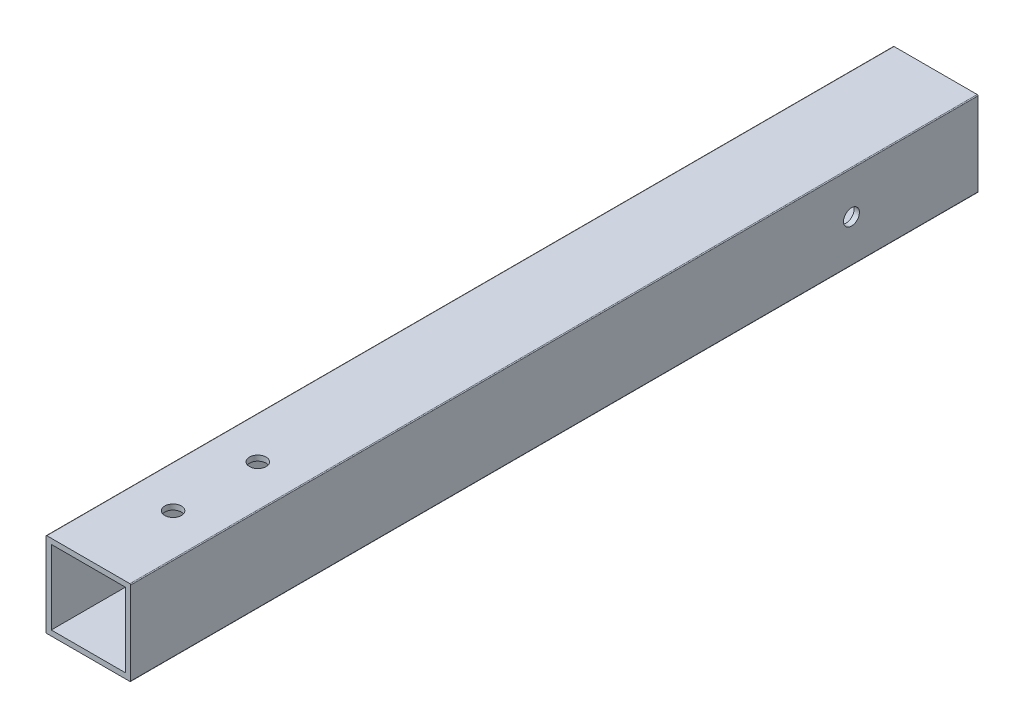
ISO-10303-21;
HEADER;
FILE_DESCRIPTION(('STEP AP214'),'2;1');
FILE_NAME('part.step','',(''),(''),'','','');
FILE_SCHEMA(('AUTOMOTIVE_DESIGN { 1 0 10303 214 1 1 1 1 }'));
ENDSEC;
DATA;
#1=APPLICATION_CONTEXT('core data for automotive mechanical design processes');
#2=APPLICATION_PROTOCOL_DEFINITION('international standard','automotive_design',2000,#1);
#3=PRODUCT_CONTEXT('',#1,'mechanical');
#4=PRODUCT('Part','Part','',(#3));
#5=PRODUCT_RELATED_PRODUCT_CATEGORY('part','',(#4));
#6=PRODUCT_DEFINITION_FORMATION('','',#4);
#7=PRODUCT_DEFINITION_CONTEXT('part definition',#1,'design');
#8=PRODUCT_DEFINITION('design','',#6,#7);
#9=PRODUCT_DEFINITION_SHAPE('','',#8);
#10=(LENGTH_UNIT() NAMED_UNIT(*) SI_UNIT(.MILLI.,.METRE.));
#11=(NAMED_UNIT(*) PLANE_ANGLE_UNIT() SI_UNIT($,.RADIAN.));
#12=(NAMED_UNIT(*) SI_UNIT($,.STERADIAN.) SOLID_ANGLE_UNIT());
#13=UNCERTAINTY_MEASURE_WITH_UNIT(LENGTH_MEASURE(1.E-05),#10,'distance_accuracy_value','');
#14=(GEOMETRIC_REPRESENTATION_CONTEXT(3) GLOBAL_UNCERTAINTY_ASSIGNED_CONTEXT((#13)) GLOBAL_UNIT_ASSIGNED_CONTEXT((#10,
#11,#12)) REPRESENTATION_CONTEXT('',''));
#15=CARTESIAN_POINT('',(0.,0.,0.));
#16=DIRECTION('',(0.,0.,1.));
#17=DIRECTION('',(1.,0.,0.));
#18=AXIS2_PLACEMENT_3D('',#15,#16,#17);
#19=CARTESIAN_POINT('',(-1.33350000000001,-1.3335,254.));
#20=DIRECTION('',(0.,0.,-1.));
#21=DIRECTION('',(-1.,0.,0.));
#22=AXIS2_PLACEMENT_3D('',#19,#20,#21);
#23=CYLINDRICAL_SURFACE('',#22,0.253999999999997);
#24=CARTESIAN_POINT('',(-1.33350000000001,-1.3335,0.));
#25=DIRECTION('',(0.,0.,-1.));
#26=DIRECTION('',(-1.,0.,0.));
#27=AXIS2_PLACEMENT_3D('',#24,#25,#26);
#28=CIRCLE('',#27,0.253999999999997);
#29=CARTESIAN_POINT('',(-1.33350000000001,-1.5875,0.));
#30=VERTEX_POINT('',#29);
#31=CARTESIAN_POINT('',(-1.5875,-1.3335,0.));
#32=VERTEX_POINT('',#31);
#33=EDGE_CURVE('E158',#30,#32,#28,.T.);
#34=ORIENTED_EDGE('',*,*,#33,.F.);
#35=DIRECTION('',(0.,0.,-1.));
#36=VECTOR('',#35,1.);
#37=CARTESIAN_POINT('',(-1.33350000000001,-1.5875,254.));
#38=LINE('',#37,#36);
#39=CARTESIAN_POINT('',(-1.33350000000001,-1.5875,254.));
#40=VERTEX_POINT('',#39);
#41=EDGE_CURVE('E11',#40,#30,#38,.T.);
#42=ORIENTED_EDGE('',*,*,#41,.F.);
#43=CARTESIAN_POINT('',(-1.33350000000001,-1.3335,254.));
#44=DIRECTION('',(0.,0.,-1.));
#45=DIRECTION('',(-1.,0.,0.));
#46=AXIS2_PLACEMENT_3D('',#43,#44,#45);
#47=CIRCLE('',#46,0.253999999999997);
#48=CARTESIAN_POINT('',(-1.5875,-1.3335,254.));
#49=VERTEX_POINT('',#48);
#50=EDGE_CURVE('E162',#40,#49,#47,.T.);
#51=ORIENTED_EDGE('',*,*,#50,.T.);
#52=DIRECTION('',(0.,0.,-1.));
#53=VECTOR('',#52,1.);
#54=CARTESIAN_POINT('',(-1.5875,-1.3335,254.));
#55=LINE('',#54,#53);
#56=EDGE_CURVE('E187',#49,#32,#55,.T.);
#57=ORIENTED_EDGE('',*,*,#56,.T.);
#58=EDGE_LOOP('',(#34,#42,#51,#57));
#59=FACE_BOUND('',#58,.T.);
#60=ADVANCED_FACE('F33',(#59),#23,.T.);
#61=CARTESIAN_POINT('',(23.5585,-1.5875,254.));
#62=DIRECTION('',(0.,-1.,0.));
#63=DIRECTION('',(1.,0.,0.));
#64=AXIS2_PLACEMENT_3D('',#61,#62,#63);
#65=PLANE('',#64);
#66=CARTESIAN_POINT('',(11.1125,-1.5875,203.2));
#67=DIRECTION('',(0.,1.,0.));
#68=DIRECTION('',(0.,0.,1.));
#69=AXIS2_PLACEMENT_3D('',#66,#67,#68);
#70=CIRCLE('',#69,2.4892);
#71=CARTESIAN_POINT('',(11.1125,-1.5875,205.6892));
#72=VERTEX_POINT('',#71);
#73=EDGE_CURVE('E228',#72,#72,#70,.T.);
#74=ORIENTED_EDGE('',*,*,#73,.T.);
#75=EDGE_LOOP('',(#74));
#76=FACE_BOUND('',#75,.T.);
#77=CARTESIAN_POINT('',(11.1125,-1.5875,228.6));
#78=DIRECTION('',(0.,1.,0.));
#79=DIRECTION('',(0.,0.,1.));
#80=AXIS2_PLACEMENT_3D('',#77,#78,#79);
#81=CIRCLE('',#80,2.4892);
#82=CARTESIAN_POINT('',(11.1125,-1.5875,231.0892));
#83=VERTEX_POINT('',#82);
#84=EDGE_CURVE('E239',#83,#83,#81,.T.);
#85=ORIENTED_EDGE('',*,*,#84,.T.);
#86=EDGE_LOOP('',(#85));
#87=FACE_BOUND('',#86,.T.);
#88=DIRECTION('',(-1.,0.,0.));
#89=VECTOR('',#88,1.);
#90=CARTESIAN_POINT('',(23.5585,-1.5875,0.));
#91=LINE('',#90,#89);
#92=CARTESIAN_POINT('',(23.5585,-1.5875,0.));
#93=VERTEX_POINT('',#92);
#94=EDGE_CURVE('E166',#93,#30,#91,.T.);
#95=ORIENTED_EDGE('',*,*,#94,.F.);
#96=DIRECTION('',(0.,0.,-1.));
#97=VECTOR('',#96,1.);
#98=CARTESIAN_POINT('',(23.5585,-1.5875,254.));
#99=LINE('',#98,#97);
#100=CARTESIAN_POINT('',(23.5585,-1.5875,254.));
#101=VERTEX_POINT('',#100);
#102=EDGE_CURVE('E41',#101,#93,#99,.T.);
#103=ORIENTED_EDGE('',*,*,#102,.F.);
#104=DIRECTION('',(-1.,0.,0.));
#105=VECTOR('',#104,1.);
#106=CARTESIAN_POINT('',(23.5585,-1.5875,254.));
#107=LINE('',#106,#105);
#108=EDGE_CURVE('E184',#101,#40,#107,.T.);
#109=ORIENTED_EDGE('',*,*,#108,.T.);
#110=ORIENTED_EDGE('',*,*,#41,.T.);
#111=EDGE_LOOP('',(#95,#103,#109,#110));
#112=FACE_BOUND('',#111,.T.);
#113=ADVANCED_FACE('F291',(#76,#87,#112),#65,.T.);
#114=CARTESIAN_POINT('',(23.5585,-1.3335,254.));
#115=DIRECTION('',(0.,0.,-1.));
#116=DIRECTION('',(-1.,0.,0.));
#117=AXIS2_PLACEMENT_3D('',#114,#115,#116);
#118=CYLINDRICAL_SURFACE('',#117,0.253999999999998);
#119=CARTESIAN_POINT('',(23.5585,-1.3335,0.));
#120=DIRECTION('',(0.,0.,-1.));
#121=DIRECTION('',(-1.,0.,0.));
#122=AXIS2_PLACEMENT_3D('',#119,#120,#121);
#123=CIRCLE('',#122,0.253999999999998);
#124=CARTESIAN_POINT('',(23.8125,-1.3335,0.));
#125=VERTEX_POINT('',#124);
#126=EDGE_CURVE('E205',#125,#93,#123,.T.);
#127=ORIENTED_EDGE('',*,*,#126,.F.);
#128=DIRECTION('',(0.,0.,-1.));
#129=VECTOR('',#128,1.);
#130=CARTESIAN_POINT('',(23.8125,-1.3335,254.));
#131=LINE('',#130,#129);
#132=CARTESIAN_POINT('',(23.8125,-1.3335,254.));
#133=VERTEX_POINT('',#132);
#134=EDGE_CURVE('E211',#133,#125,#131,.T.);
#135=ORIENTED_EDGE('',*,*,#134,.F.);
#136=CARTESIAN_POINT('',(23.5585,-1.3335,254.));
#137=DIRECTION('',(0.,0.,-1.));
#138=DIRECTION('',(-1.,0.,0.));
#139=AXIS2_PLACEMENT_3D('',#136,#137,#138);
#140=CIRCLE('',#139,0.253999999999998);
#141=EDGE_CURVE('E181',#133,#101,#140,.T.);
#142=ORIENTED_EDGE('',*,*,#141,.T.);
#143=ORIENTED_EDGE('',*,*,#102,.T.);
#144=EDGE_LOOP('',(#127,#135,#142,#143));
#145=FACE_BOUND('',#144,.T.);
#146=ADVANCED_FACE('F262',(#145),#118,.T.);
#147=CARTESIAN_POINT('',(23.8125,23.5585,254.));
#148=DIRECTION('',(1.,0.,0.));
#149=DIRECTION('',(0.,1.,0.));
#150=AXIS2_PLACEMENT_3D('',#147,#148,#149);
#151=PLANE('',#150);
#152=CARTESIAN_POINT('',(23.8125,11.1125,37.933268304));
#153=DIRECTION('',(1.,0.,0.));
#154=DIRECTION('',(0.,1.,0.));
#155=AXIS2_PLACEMENT_3D('',#152,#153,#154);
#156=CIRCLE('',#155,2.38125);
#157=CARTESIAN_POINT('',(23.8125,13.49375,37.933268304));
#158=VERTEX_POINT('',#157);
#159=EDGE_CURVE('E250',#158,#158,#156,.T.);
#160=ORIENTED_EDGE('',*,*,#159,.F.);
#161=EDGE_LOOP('',(#160));
#162=FACE_BOUND('',#161,.T.);
#163=DIRECTION('',(0.,-1.,0.));
#164=VECTOR('',#163,1.);
#165=CARTESIAN_POINT('',(23.8125,23.5585,0.));
#166=LINE('',#165,#164);
#167=CARTESIAN_POINT('',(23.8125,23.5585,0.));
#168=VERTEX_POINT('',#167);
#169=EDGE_CURVE('E202',#168,#125,#166,.T.);
#170=ORIENTED_EDGE('',*,*,#169,.F.);
#171=DIRECTION('',(0.,0.,-1.));
#172=VECTOR('',#171,1.);
#173=CARTESIAN_POINT('',(23.8125,23.5585,254.));
#174=LINE('',#173,#172);
#175=CARTESIAN_POINT('',(23.8125,23.5585,254.));
#176=VERTEX_POINT('',#175);
#177=EDGE_CURVE('E213',#176,#168,#174,.T.);
#178=ORIENTED_EDGE('',*,*,#177,.F.);
#179=DIRECTION('',(0.,-1.,0.));
#180=VECTOR('',#179,1.);
#181=CARTESIAN_POINT('',(23.8125,23.5585,254.));
#182=LINE('',#181,#180);
#183=EDGE_CURVE('E178',#176,#133,#182,.T.);
#184=ORIENTED_EDGE('',*,*,#183,.T.);
#185=ORIENTED_EDGE('',*,*,#134,.T.);
#186=EDGE_LOOP('',(#170,#178,#184,#185));
#187=FACE_BOUND('',#186,.T.);
#188=ADVANCED_FACE('F258',(#162,#187),#151,.T.);
#189=CARTESIAN_POINT('',(23.5585,23.5585,254.));
#190=DIRECTION('',(0.,0.,-1.));
#191=DIRECTION('',(-1.,0.,0.));
#192=AXIS2_PLACEMENT_3D('',#189,#190,#191);
#193=CYLINDRICAL_SURFACE('',#192,0.254000000000001);
#194=CARTESIAN_POINT('',(23.5585,23.5585,0.));
#195=DIRECTION('',(0.,0.,-1.));
#196=DIRECTION('',(-1.,0.,0.));
#197=AXIS2_PLACEMENT_3D('',#194,#195,#196);
#198=CIRCLE('',#197,0.254000000000001);
#199=CARTESIAN_POINT('',(23.5585,23.8125,0.));
#200=VERTEX_POINT('',#199);
#201=EDGE_CURVE('E199',#200,#168,#198,.T.);
#202=ORIENTED_EDGE('',*,*,#201,.F.);
#203=DIRECTION('',(0.,0.,-1.));
#204=VECTOR('',#203,1.);
#205=CARTESIAN_POINT('',(23.5585,23.8125,254.));
#206=LINE('',#205,#204);
#207=CARTESIAN_POINT('',(23.5585,23.8125,254.));
#208=VERTEX_POINT('',#207);
#209=EDGE_CURVE('E215',#208,#200,#206,.T.);
#210=ORIENTED_EDGE('',*,*,#209,.F.);
#211=CARTESIAN_POINT('',(23.5585,23.5585,254.));
#212=DIRECTION('',(0.,0.,-1.));
#213=DIRECTION('',(-1.,0.,0.));
#214=AXIS2_PLACEMENT_3D('',#211,#212,#213);
#215=CIRCLE('',#214,0.254000000000001);
#216=EDGE_CURVE('E175',#208,#176,#215,.T.);
#217=ORIENTED_EDGE('',*,*,#216,.T.);
#218=ORIENTED_EDGE('',*,*,#177,.T.);
#219=EDGE_LOOP('',(#202,#210,#217,#218));
#220=FACE_BOUND('',#219,.T.);
#221=ADVANCED_FACE('F261',(#220),#193,.T.);
#222=CARTESIAN_POINT('',(-1.33350000000001,23.8125,254.));
#223=DIRECTION('',(0.,1.,0.));
#224=DIRECTION('',(0.,0.,1.));
#225=AXIS2_PLACEMENT_3D('',#222,#223,#224);
#226=PLANE('',#225);
#227=CARTESIAN_POINT('',(11.1125,23.8125,203.2));
#228=DIRECTION('',(0.,1.,0.));
#229=DIRECTION('',(0.,0.,1.));
#230=AXIS2_PLACEMENT_3D('',#227,#228,#229);
#231=CIRCLE('',#230,2.4892);
#232=CARTESIAN_POINT('',(11.1125,23.8125,205.6892));
#233=VERTEX_POINT('',#232);
#234=EDGE_CURVE('E234',#233,#233,#231,.T.);
#235=ORIENTED_EDGE('',*,*,#234,.F.);
#236=EDGE_LOOP('',(#235));
#237=FACE_BOUND('',#236,.T.);
#238=CARTESIAN_POINT('',(11.1125,23.8125,228.6));
#239=DIRECTION('',(0.,1.,0.));
#240=DIRECTION('',(0.,0.,1.));
#241=AXIS2_PLACEMENT_3D('',#238,#239,#240);
#242=CIRCLE('',#241,2.4892);
#243=CARTESIAN_POINT('',(11.1125,23.8125,231.0892));
#244=VERTEX_POINT('',#243);
#245=EDGE_CURVE('E244',#244,#244,#242,.T.);
#246=ORIENTED_EDGE('',*,*,#245,.F.);
#247=EDGE_LOOP('',(#246));
#248=FACE_BOUND('',#247,.T.);
#249=DIRECTION('',(1.,0.,0.));
#250=VECTOR('',#249,1.);
#251=CARTESIAN_POINT('',(-1.33350000000001,23.8125,0.));
#252=LINE('',#251,#250);
#253=CARTESIAN_POINT('',(-1.33350000000001,23.8125,0.));
#254=VERTEX_POINT('',#253);
#255=EDGE_CURVE('E196',#254,#200,#252,.T.);
#256=ORIENTED_EDGE('',*,*,#255,.F.);
#257=DIRECTION('',(0.,0.,-1.));
#258=VECTOR('',#257,1.);
#259=CARTESIAN_POINT('',(-1.33350000000001,23.8125,254.));
#260=LINE('',#259,#258);
#261=CARTESIAN_POINT('',(-1.33350000000001,23.8125,254.));
#262=VERTEX_POINT('',#261);
#263=EDGE_CURVE('E217',#262,#254,#260,.T.);
#264=ORIENTED_EDGE('',*,*,#263,.F.);
#265=DIRECTION('',(1.,0.,0.));
#266=VECTOR('',#265,1.);
#267=CARTESIAN_POINT('',(-1.33350000000001,23.8125,254.));
#268=LINE('',#267,#266);
#269=EDGE_CURVE('E172',#262,#208,#268,.T.);
#270=ORIENTED_EDGE('',*,*,#269,.T.);
#271=ORIENTED_EDGE('',*,*,#209,.T.);
#272=EDGE_LOOP('',(#256,#264,#270,#271));
#273=FACE_BOUND('',#272,.T.);
#274=ADVANCED_FACE('F278',(#237,#248,#273),#226,.T.);
#275=CARTESIAN_POINT('',(-1.33350000000001,23.5585,254.));
#276=DIRECTION('',(0.,0.,-1.));
#277=DIRECTION('',(-1.,0.,0.));
#278=AXIS2_PLACEMENT_3D('',#275,#276,#277);
#279=CYLINDRICAL_SURFACE('',#278,0.253999999999992);
#280=CARTESIAN_POINT('',(-1.33350000000001,23.5585,0.));
#281=DIRECTION('',(0.,0.,-1.));
#282=DIRECTION('',(-1.,0.,0.));
#283=AXIS2_PLACEMENT_3D('',#280,#281,#282);
#284=CIRCLE('',#283,0.253999999999992);
#285=CARTESIAN_POINT('',(-1.5875,23.5585,0.));
#286=VERTEX_POINT('',#285);
#287=EDGE_CURVE('E193',#286,#254,#284,.T.);
#288=ORIENTED_EDGE('',*,*,#287,.F.);
#289=DIRECTION('',(0.,0.,-1.));
#290=VECTOR('',#289,1.);
#291=CARTESIAN_POINT('',(-1.5875,23.5585,254.));
#292=LINE('',#291,#290);
#293=CARTESIAN_POINT('',(-1.5875,23.5585,254.));
#294=VERTEX_POINT('',#293);
#295=EDGE_CURVE('E219',#294,#286,#292,.T.);
#296=ORIENTED_EDGE('',*,*,#295,.F.);
#297=CARTESIAN_POINT('',(-1.33350000000001,23.5585,254.));
#298=DIRECTION('',(0.,0.,-1.));
#299=DIRECTION('',(-1.,0.,0.));
#300=AXIS2_PLACEMENT_3D('',#297,#298,#299);
#301=CIRCLE('',#300,0.253999999999992);
#302=EDGE_CURVE('E169',#294,#262,#301,.T.);
#303=ORIENTED_EDGE('',*,*,#302,.T.);
#304=ORIENTED_EDGE('',*,*,#263,.T.);
#305=EDGE_LOOP('',(#288,#296,#303,#304));
#306=FACE_BOUND('',#305,.T.);
#307=ADVANCED_FACE('F281',(#306),#279,.T.);
#308=CARTESIAN_POINT('',(-1.5875,-1.3335,254.));
#309=DIRECTION('',(-1.,0.,0.));
#310=DIRECTION('',(0.,-1.,0.));
#311=AXIS2_PLACEMENT_3D('',#308,#309,#310);
#312=PLANE('',#311);
#313=CARTESIAN_POINT('',(-1.58750000000001,11.1125,37.933268304));
#314=DIRECTION('',(1.,0.,0.));
#315=DIRECTION('',(0.,1.,0.));
#316=AXIS2_PLACEMENT_3D('',#313,#314,#315);
#317=CIRCLE('',#316,2.38125);
#318=CARTESIAN_POINT('',(-1.5875,13.49375,37.933268304));
#319=VERTEX_POINT('',#318);
#320=EDGE_CURVE('E224',#319,#319,#317,.T.);
#321=ORIENTED_EDGE('',*,*,#320,.T.);
#322=EDGE_LOOP('',(#321));
#323=FACE_BOUND('',#322,.T.);
#324=DIRECTION('',(0.,1.,0.));
#325=VECTOR('',#324,1.);
#326=CARTESIAN_POINT('',(-1.5875,-1.3335,0.));
#327=LINE('',#326,#325);
#328=EDGE_CURVE('E190',#32,#286,#327,.T.);
#329=ORIENTED_EDGE('',*,*,#328,.F.);
#330=ORIENTED_EDGE('',*,*,#56,.F.);
#331=DIRECTION('',(0.,1.,0.));
#332=VECTOR('',#331,1.);
#333=CARTESIAN_POINT('',(-1.5875,-1.3335,254.));
#334=LINE('',#333,#332);
#335=EDGE_CURVE('E165',#49,#294,#334,.T.);
#336=ORIENTED_EDGE('',*,*,#335,.T.);
#337=ORIENTED_EDGE('',*,*,#295,.T.);
#338=EDGE_LOOP('',(#329,#330,#336,#337));
#339=FACE_BOUND('',#338,.T.);
#340=ADVANCED_FACE('F285',(#323,#339),#312,.T.);
#341=CARTESIAN_POINT('',(-1.33350000000001,-1.3335,254.));
#342=DIRECTION('',(0.,0.,-1.));
#343=DIRECTION('',(-1.,0.,0.));
#344=AXIS2_PLACEMENT_3D('',#341,#342,#343);
#345=PLANE('',#344);
#346=DIRECTION('',(1.,0.,0.));
#347=VECTOR('',#346,1.);
#348=CARTESIAN_POINT('',(0.,22.225,254.));
#349=LINE('',#348,#347);
#350=CARTESIAN_POINT('',(0.,22.225,254.));
#351=VERTEX_POINT('',#350);
#352=CARTESIAN_POINT('',(22.225,22.225,254.));
#353=VERTEX_POINT('',#352);
#354=EDGE_CURVE('E130',#351,#353,#349,.T.);
#355=ORIENTED_EDGE('',*,*,#354,.T.);
#356=DIRECTION('',(0.,-1.,0.));
#357=VECTOR('',#356,1.);
#358=CARTESIAN_POINT('',(22.225,22.225,254.));
#359=LINE('',#358,#357);
#360=CARTESIAN_POINT('',(22.225,0.,254.));
#361=VERTEX_POINT('',#360);
#362=EDGE_CURVE('E124',#353,#361,#359,.T.);
#363=ORIENTED_EDGE('',*,*,#362,.T.);
#364=DIRECTION('',(-1.,0.,0.));
#365=VECTOR('',#364,1.);
#366=CARTESIAN_POINT('',(0.,0.,254.));
#367=LINE('',#366,#365);
#368=CARTESIAN_POINT('',(0.,0.,254.));
#369=VERTEX_POINT('',#368);
#370=EDGE_CURVE('E133',#361,#369,#367,.T.);
#371=ORIENTED_EDGE('',*,*,#370,.T.);
#372=DIRECTION('',(0.,1.,0.));
#373=VECTOR('',#372,1.);
#374=CARTESIAN_POINT('',(0.,22.225,254.));
#375=LINE('',#374,#373);
#376=EDGE_CURVE('E49',#369,#351,#375,.T.);
#377=ORIENTED_EDGE('',*,*,#376,.T.);
#378=EDGE_LOOP('',(#355,#363,#371,#377));
#379=FACE_BOUND('',#378,.T.);
#380=ORIENTED_EDGE('',*,*,#50,.F.);
#381=ORIENTED_EDGE('',*,*,#108,.F.);
#382=ORIENTED_EDGE('',*,*,#141,.F.);
#383=ORIENTED_EDGE('',*,*,#183,.F.);
#384=ORIENTED_EDGE('',*,*,#216,.F.);
#385=ORIENTED_EDGE('',*,*,#269,.F.);
#386=ORIENTED_EDGE('',*,*,#302,.F.);
#387=ORIENTED_EDGE('',*,*,#335,.F.);
#388=EDGE_LOOP('',(#380,#381,#382,#383,#384,#385,#386,#387));
#389=FACE_BOUND('',#388,.T.);
#390=ADVANCED_FACE('F137',(#379,#389),#345,.F.);
#391=CARTESIAN_POINT('',(-1.33350000000001,-1.3335,0.));
#392=DIRECTION('',(0.,0.,-1.));
#393=DIRECTION('',(-1.,0.,0.));
#394=AXIS2_PLACEMENT_3D('',#391,#392,#393);
#395=PLANE('',#394);
#396=DIRECTION('',(0.,-1.,0.));
#397=VECTOR('',#396,1.);
#398=CARTESIAN_POINT('',(22.225,22.225,0.));
#399=LINE('',#398,#397);
#400=CARTESIAN_POINT('',(22.225,22.225,0.));
#401=VERTEX_POINT('',#400);
#402=CARTESIAN_POINT('',(22.225,0.,0.));
#403=VERTEX_POINT('',#402);
#404=EDGE_CURVE('E57',#401,#403,#399,.T.);
#405=ORIENTED_EDGE('',*,*,#404,.F.);
#406=DIRECTION('',(1.,0.,0.));
#407=VECTOR('',#406,1.);
#408=CARTESIAN_POINT('',(0.,22.225,0.));
#409=LINE('',#408,#407);
#410=CARTESIAN_POINT('',(0.,22.225,0.));
#411=VERTEX_POINT('',#410);
#412=EDGE_CURVE('E140',#411,#401,#409,.T.);
#413=ORIENTED_EDGE('',*,*,#412,.F.);
#414=DIRECTION('',(0.,1.,0.));
#415=VECTOR('',#414,1.);
#416=CARTESIAN_POINT('',(0.,22.225,0.));
#417=LINE('',#416,#415);
#418=CARTESIAN_POINT('',(0.,0.,0.));
#419=VERTEX_POINT('',#418);
#420=EDGE_CURVE('E143',#419,#411,#417,.T.);
#421=ORIENTED_EDGE('',*,*,#420,.F.);
#422=DIRECTION('',(-1.,0.,0.));
#423=VECTOR('',#422,1.);
#424=CARTESIAN_POINT('',(0.,0.,0.));
#425=LINE('',#424,#423);
#426=EDGE_CURVE('E152',#403,#419,#425,.T.);
#427=ORIENTED_EDGE('',*,*,#426,.F.);
#428=EDGE_LOOP('',(#405,#413,#421,#427));
#429=FACE_BOUND('',#428,.T.);
#430=ORIENTED_EDGE('',*,*,#33,.T.);
#431=ORIENTED_EDGE('',*,*,#328,.T.);
#432=ORIENTED_EDGE('',*,*,#287,.T.);
#433=ORIENTED_EDGE('',*,*,#255,.T.);
#434=ORIENTED_EDGE('',*,*,#201,.T.);
#435=ORIENTED_EDGE('',*,*,#169,.T.);
#436=ORIENTED_EDGE('',*,*,#126,.T.);
#437=ORIENTED_EDGE('',*,*,#94,.T.);
#438=EDGE_LOOP('',(#430,#431,#432,#433,#434,#435,#436,#437));
#439=FACE_BOUND('',#438,.T.);
#440=ADVANCED_FACE('F269',(#429,#439),#395,.T.);
#441=CARTESIAN_POINT('',(22.225,22.225,254.));
#442=DIRECTION('',(1.,0.,0.));
#443=DIRECTION('',(0.,1.,0.));
#444=AXIS2_PLACEMENT_3D('',#441,#442,#443);
#445=PLANE('',#444);
#446=CARTESIAN_POINT('',(22.225,11.1125,37.933268304));
#447=DIRECTION('',(1.,0.,0.));
#448=DIRECTION('',(0.,1.,0.));
#449=AXIS2_PLACEMENT_3D('',#446,#447,#448);
#450=CIRCLE('',#449,2.38125);
#451=CARTESIAN_POINT('',(22.225,13.49375,37.933268304));
#452=VERTEX_POINT('',#451);
#453=EDGE_CURVE('E146',#452,#452,#450,.T.);
#454=ORIENTED_EDGE('',*,*,#453,.T.);
#455=EDGE_LOOP('',(#454));
#456=FACE_BOUND('',#455,.T.);
#457=ORIENTED_EDGE('',*,*,#404,.T.);
#458=DIRECTION('',(0.,0.,-1.));
#459=VECTOR('',#458,1.);
#460=CARTESIAN_POINT('',(22.225,0.,254.));
#461=LINE('',#460,#459);
#462=EDGE_CURVE('E120',#361,#403,#461,.T.);
#463=ORIENTED_EDGE('',*,*,#462,.F.);
#464=ORIENTED_EDGE('',*,*,#362,.F.);
#465=DIRECTION('',(0.,0.,-1.));
#466=VECTOR('',#465,1.);
#467=CARTESIAN_POINT('',(22.225,22.225,254.));
#468=LINE('',#467,#466);
#469=EDGE_CURVE('E156',#353,#401,#468,.T.);
#470=ORIENTED_EDGE('',*,*,#469,.T.);
#471=EDGE_LOOP('',(#457,#463,#464,#470));
#472=FACE_BOUND('',#471,.T.);
#473=ADVANCED_FACE('F122',(#456,#472),#445,.F.);
#474=CARTESIAN_POINT('',(0.,22.225,254.));
#475=DIRECTION('',(0.,1.,0.));
#476=DIRECTION('',(-1.,0.,0.));
#477=AXIS2_PLACEMENT_3D('',#474,#475,#476);
#478=PLANE('',#477);
#479=CARTESIAN_POINT('',(11.1125,22.225,203.2));
#480=DIRECTION('',(0.,1.,0.));
#481=DIRECTION('',(-1.,0.,0.));
#482=AXIS2_PLACEMENT_3D('',#479,#480,#481);
#483=CIRCLE('',#482,2.4892);
#484=CARTESIAN_POINT('',(8.62329999999999,22.225,203.2));
#485=VERTEX_POINT('',#484);
#486=EDGE_CURVE('E247',#485,#485,#483,.T.);
#487=ORIENTED_EDGE('',*,*,#486,.T.);
#488=EDGE_LOOP('',(#487));
#489=FACE_BOUND('',#488,.T.);
#490=CARTESIAN_POINT('',(11.1125,22.225,228.6));
#491=DIRECTION('',(0.,1.,0.));
#492=DIRECTION('',(-1.,0.,0.));
#493=AXIS2_PLACEMENT_3D('',#490,#491,#492);
#494=CIRCLE('',#493,2.4892);
#495=CARTESIAN_POINT('',(8.62329999999999,22.225,228.6));
#496=VERTEX_POINT('',#495);
#497=EDGE_CURVE('E227',#496,#496,#494,.T.);
#498=ORIENTED_EDGE('',*,*,#497,.T.);
#499=EDGE_LOOP('',(#498));
#500=FACE_BOUND('',#499,.T.);
#501=ORIENTED_EDGE('',*,*,#412,.T.);
#502=ORIENTED_EDGE('',*,*,#469,.F.);
#503=ORIENTED_EDGE('',*,*,#354,.F.);
#504=DIRECTION('',(0.,0.,-1.));
#505=VECTOR('',#504,1.);
#506=CARTESIAN_POINT('',(0.,22.225,254.));
#507=LINE('',#506,#505);
#508=EDGE_CURVE('E159',#351,#411,#507,.T.);
#509=ORIENTED_EDGE('',*,*,#508,.T.);
#510=EDGE_LOOP('',(#501,#502,#503,#509));
#511=FACE_BOUND('',#510,.T.);
#512=ADVANCED_FACE('F330',(#489,#500,#511),#478,.F.);
#513=CARTESIAN_POINT('',(0.,22.225,254.));
#514=DIRECTION('',(-1.,0.,0.));
#515=DIRECTION('',(0.,-1.,0.));
#516=AXIS2_PLACEMENT_3D('',#513,#514,#515);
#517=PLANE('',#516);
#518=CARTESIAN_POINT('',(0.,11.1125,37.933268304));
#519=DIRECTION('',(-1.,0.,0.));
#520=DIRECTION('',(0.,-1.,0.));
#521=AXIS2_PLACEMENT_3D('',#518,#519,#520);
#522=CIRCLE('',#521,2.38125);
#523=CARTESIAN_POINT('',(0.,8.73125000000001,37.933268304));
#524=VERTEX_POINT('',#523);
#525=EDGE_CURVE('E222',#524,#524,#522,.T.);
#526=ORIENTED_EDGE('',*,*,#525,.T.);
#527=EDGE_LOOP('',(#526));
#528=FACE_BOUND('',#527,.T.);
#529=ORIENTED_EDGE('',*,*,#420,.T.);
#530=ORIENTED_EDGE('',*,*,#508,.F.);
#531=ORIENTED_EDGE('',*,*,#376,.F.);
#532=DIRECTION('',(0.,0.,-1.));
#533=VECTOR('',#532,1.);
#534=CARTESIAN_POINT('',(0.,0.,254.));
#535=LINE('',#534,#533);
#536=EDGE_CURVE('E129',#369,#419,#535,.T.);
#537=ORIENTED_EDGE('',*,*,#536,.T.);
#538=EDGE_LOOP('',(#529,#530,#531,#537));
#539=FACE_BOUND('',#538,.T.);
#540=ADVANCED_FACE('F335',(#528,#539),#517,.F.);
#541=CARTESIAN_POINT('',(0.,0.,254.));
#542=DIRECTION('',(0.,-1.,0.));
#543=DIRECTION('',(1.,0.,0.));
#544=AXIS2_PLACEMENT_3D('',#541,#542,#543);
#545=PLANE('',#544);
#546=CARTESIAN_POINT('',(11.1125,0.,203.2));
#547=DIRECTION('',(0.,-1.,0.));
#548=DIRECTION('',(1.,0.,0.));
#549=AXIS2_PLACEMENT_3D('',#546,#547,#548);
#550=CIRCLE('',#549,2.4892);
#551=CARTESIAN_POINT('',(13.6017,0.,203.2));
#552=VERTEX_POINT('',#551);
#553=EDGE_CURVE('E36',#552,#552,#550,.T.);
#554=ORIENTED_EDGE('',*,*,#553,.T.);
#555=EDGE_LOOP('',(#554));
#556=FACE_BOUND('',#555,.T.);
#557=CARTESIAN_POINT('',(11.1125,0.,228.6));
#558=DIRECTION('',(0.,-1.,0.));
#559=DIRECTION('',(1.,0.,0.));
#560=AXIS2_PLACEMENT_3D('',#557,#558,#559);
#561=CIRCLE('',#560,2.4892);
#562=CARTESIAN_POINT('',(13.6017,0.,228.6));
#563=VERTEX_POINT('',#562);
#564=EDGE_CURVE('E225',#563,#563,#561,.T.);
#565=ORIENTED_EDGE('',*,*,#564,.T.);
#566=EDGE_LOOP('',(#565));
#567=FACE_BOUND('',#566,.T.);
#568=ORIENTED_EDGE('',*,*,#426,.T.);
#569=ORIENTED_EDGE('',*,*,#536,.F.);
#570=ORIENTED_EDGE('',*,*,#370,.F.);
#571=ORIENTED_EDGE('',*,*,#462,.T.);
#572=EDGE_LOOP('',(#568,#569,#570,#571));
#573=FACE_BOUND('',#572,.T.);
#574=ADVANCED_FACE('F134',(#556,#567,#573),#545,.F.);
#575=CARTESIAN_POINT('',(-1.58750000000001,11.1125,37.933268304));
#576=DIRECTION('',(1.,0.,0.));
#577=DIRECTION('',(0.,1.,0.));
#578=AXIS2_PLACEMENT_3D('',#575,#576,#577);
#579=CYLINDRICAL_SURFACE('',#578,2.38125);
#580=ORIENTED_EDGE('',*,*,#320,.F.);
#581=EDGE_LOOP('',(#580));
#582=FACE_BOUND('',#581,.T.);
#583=ORIENTED_EDGE('',*,*,#525,.F.);
#584=EDGE_LOOP('',(#583));
#585=FACE_BOUND('',#584,.T.);
#586=ADVANCED_FACE('F349',(#582,#585),#579,.F.);
#587=ORIENTED_EDGE('',*,*,#159,.T.);
#588=EDGE_LOOP('',(#587));
#589=FACE_BOUND('',#588,.T.);
#590=ORIENTED_EDGE('',*,*,#453,.F.);
#591=EDGE_LOOP('',(#590));
#592=FACE_BOUND('',#591,.T.);
#593=ADVANCED_FACE('F255',(#589,#592),#579,.F.);
#594=CARTESIAN_POINT('',(11.1125,-1.5875,228.6));
#595=DIRECTION('',(0.,1.,0.));
#596=DIRECTION('',(0.,0.,1.));
#597=AXIS2_PLACEMENT_3D('',#594,#595,#596);
#598=CYLINDRICAL_SURFACE('',#597,2.4892);
#599=ORIENTED_EDGE('',*,*,#84,.F.);
#600=EDGE_LOOP('',(#599));
#601=FACE_BOUND('',#600,.T.);
#602=ORIENTED_EDGE('',*,*,#564,.F.);
#603=EDGE_LOOP('',(#602));
#604=FACE_BOUND('',#603,.T.);
#605=ADVANCED_FACE('F357',(#601,#604),#598,.F.);
#606=CARTESIAN_POINT('',(11.1125,-1.5875,203.2));
#607=DIRECTION('',(0.,1.,0.));
#608=DIRECTION('',(0.,0.,1.));
#609=AXIS2_PLACEMENT_3D('',#606,#607,#608);
#610=CYLINDRICAL_SURFACE('',#609,2.4892);
#611=ORIENTED_EDGE('',*,*,#73,.F.);
#612=EDGE_LOOP('',(#611));
#613=FACE_BOUND('',#612,.T.);
#614=ORIENTED_EDGE('',*,*,#553,.F.);
#615=EDGE_LOOP('',(#614));
#616=FACE_BOUND('',#615,.T.);
#617=ADVANCED_FACE('F362',(#613,#616),#610,.F.);
#618=ORIENTED_EDGE('',*,*,#245,.T.);
#619=EDGE_LOOP('',(#618));
#620=FACE_BOUND('',#619,.T.);
#621=ORIENTED_EDGE('',*,*,#497,.F.);
#622=EDGE_LOOP('',(#621));
#623=FACE_BOUND('',#622,.T.);
#624=ADVANCED_FACE('F365',(#620,#623),#598,.F.);
#625=ORIENTED_EDGE('',*,*,#234,.T.);
#626=EDGE_LOOP('',(#625));
#627=FACE_BOUND('',#626,.T.);
#628=ORIENTED_EDGE('',*,*,#486,.F.);
#629=EDGE_LOOP('',(#628));
#630=FACE_BOUND('',#629,.T.);
#631=ADVANCED_FACE('F375',(#627,#630),#610,.F.);
#632=CLOSED_SHELL('',(#60,#113,#146,#188,#221,#274,#307,#340,#390,#440,#473,#512,#540,#574,#586,
#593,#605,#617,#624,#631));
#633=MANIFOLD_SOLID_BREP('B2',#632);
#634=ADVANCED_BREP_SHAPE_REPRESENTATION('',(#18,#633),#14);
#635=SHAPE_DEFINITION_REPRESENTATION(#9,#634);
ENDSEC;
END-ISO-10303-21;
